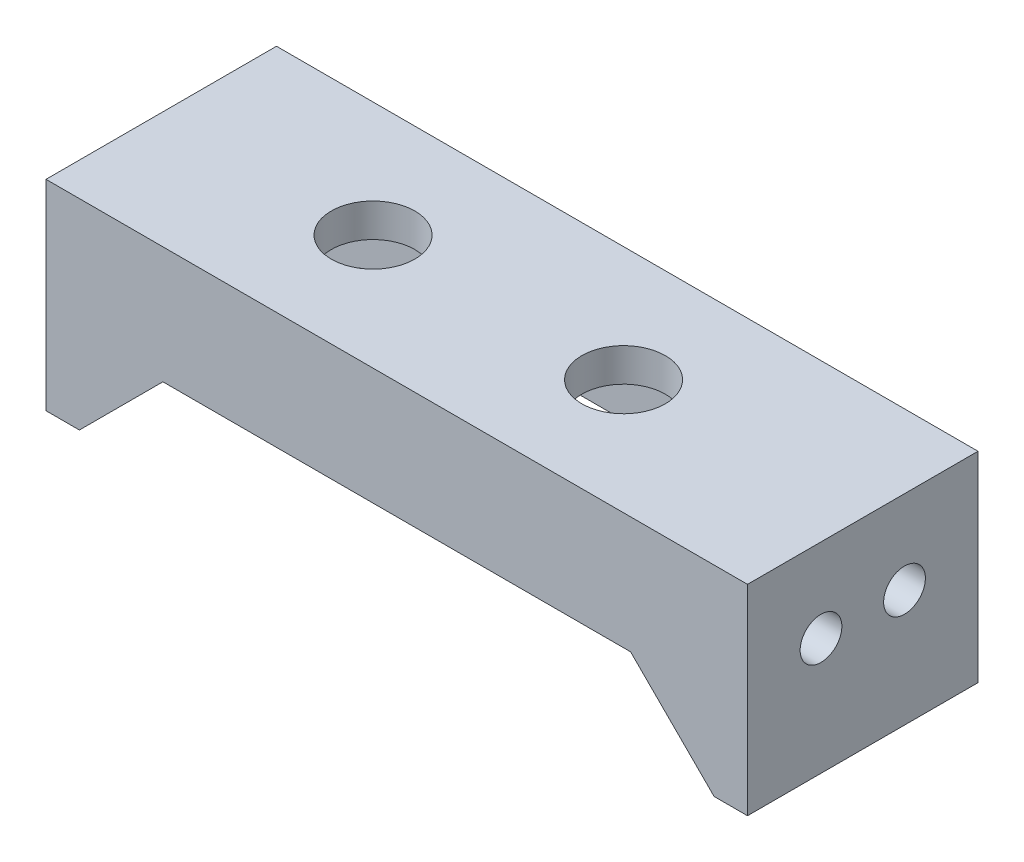
ISO-10303-21;
HEADER;
FILE_DESCRIPTION(('STEP AP214'),'2;1');
FILE_NAME('part.step','',(''),(''),'','','');
FILE_SCHEMA(('AUTOMOTIVE_DESIGN { 1 0 10303 214 1 1 1 1 }'));
ENDSEC;
DATA;
#1=APPLICATION_CONTEXT('core data for automotive mechanical design processes');
#2=APPLICATION_PROTOCOL_DEFINITION('international standard','automotive_design',2000,#1);
#3=PRODUCT_CONTEXT('',#1,'mechanical');
#4=PRODUCT('Part','Part','',(#3));
#5=PRODUCT_RELATED_PRODUCT_CATEGORY('part','',(#4));
#6=PRODUCT_DEFINITION_FORMATION('','',#4);
#7=PRODUCT_DEFINITION_CONTEXT('part definition',#1,'design');
#8=PRODUCT_DEFINITION('design','',#6,#7);
#9=PRODUCT_DEFINITION_SHAPE('','',#8);
#10=(LENGTH_UNIT() NAMED_UNIT(*) SI_UNIT(.MILLI.,.METRE.));
#11=(NAMED_UNIT(*) PLANE_ANGLE_UNIT() SI_UNIT($,.RADIAN.));
#12=(NAMED_UNIT(*) SI_UNIT($,.STERADIAN.) SOLID_ANGLE_UNIT());
#13=UNCERTAINTY_MEASURE_WITH_UNIT(LENGTH_MEASURE(1.E-05),#10,'distance_accuracy_value','');
#14=(GEOMETRIC_REPRESENTATION_CONTEXT(3) GLOBAL_UNCERTAINTY_ASSIGNED_CONTEXT((#13)) GLOBAL_UNIT_ASSIGNED_CONTEXT((#10,
#11,#12)) REPRESENTATION_CONTEXT('',''));
#15=CARTESIAN_POINT('',(0.,0.,0.));
#16=DIRECTION('',(0.,0.,1.));
#17=DIRECTION('',(1.,0.,0.));
#18=AXIS2_PLACEMENT_3D('',#15,#16,#17);
#19=CARTESIAN_POINT('',(0.,0.,0.));
#20=DIRECTION('',(0.,1.,0.));
#21=DIRECTION('',(0.,0.,1.));
#22=AXIS2_PLACEMENT_3D('',#19,#20,#21);
#23=PLANE('',#22);
#24=CARTESIAN_POINT('',(-8.31990662492034,0.,0.));
#25=DIRECTION('',(0.,-1.,0.));
#26=DIRECTION('',(0.,0.,-1.));
#27=AXIS2_PLACEMENT_3D('',#24,#25,#26);
#28=CIRCLE('',#27,2.5);
#29=CARTESIAN_POINT('',(-8.31990662492034,0.,-2.5));
#30=VERTEX_POINT('',#29);
#31=EDGE_CURVE('E274',#30,#30,#28,.T.);
#32=ORIENTED_EDGE('',*,*,#31,.F.);
#33=EDGE_LOOP('',(#32));
#34=FACE_BOUND('',#33,.T.);
#35=CARTESIAN_POINT('',(6.68009337507966,0.,0.));
#36=DIRECTION('',(0.,-1.,0.));
#37=DIRECTION('',(0.,0.,-1.));
#38=AXIS2_PLACEMENT_3D('',#35,#36,#37);
#39=CIRCLE('',#38,2.5);
#40=CARTESIAN_POINT('',(6.68009337507966,0.,-2.5));
#41=VERTEX_POINT('',#40);
#42=EDGE_CURVE('E267',#41,#41,#39,.T.);
#43=ORIENTED_EDGE('',*,*,#42,.F.);
#44=EDGE_LOOP('',(#43));
#45=FACE_BOUND('',#44,.T.);
#46=DIRECTION('',(0.,0.,1.));
#47=VECTOR('',#46,1.);
#48=CARTESIAN_POINT('',(-19.,0.,6.9));
#49=LINE('',#48,#47);
#50=CARTESIAN_POINT('',(-19.,0.,-4.9));
#51=VERTEX_POINT('',#50);
#52=CARTESIAN_POINT('',(-19.,0.,4.9));
#53=VERTEX_POINT('',#52);
#54=EDGE_CURVE('E153',#51,#53,#49,.T.);
#55=ORIENTED_EDGE('',*,*,#54,.F.);
#56=DIRECTION('',(-1.,0.,0.));
#57=VECTOR('',#56,1.);
#58=CARTESIAN_POINT('',(-19.,0.,-4.9));
#59=LINE('',#58,#57);
#60=CARTESIAN_POINT('',(19.,0.,-4.9));
#61=VERTEX_POINT('',#60);
#62=EDGE_CURVE('E138',#61,#51,#59,.T.);
#63=ORIENTED_EDGE('',*,*,#62,.F.);
#64=DIRECTION('',(0.,0.,-1.));
#65=VECTOR('',#64,1.);
#66=CARTESIAN_POINT('',(19.,0.,6.9));
#67=LINE('',#66,#65);
#68=CARTESIAN_POINT('',(19.,0.,4.9));
#69=VERTEX_POINT('',#68);
#70=EDGE_CURVE('E208',#69,#61,#67,.T.);
#71=ORIENTED_EDGE('',*,*,#70,.F.);
#72=DIRECTION('',(-1.,0.,0.));
#73=VECTOR('',#72,1.);
#74=CARTESIAN_POINT('',(-19.,0.,4.9));
#75=LINE('',#74,#73);
#76=EDGE_CURVE('E160',#69,#53,#75,.T.);
#77=ORIENTED_EDGE('',*,*,#76,.T.);
#78=EDGE_LOOP('',(#55,#63,#71,#77));
#79=FACE_BOUND('',#78,.T.);
#80=ADVANCED_FACE('F37',(#34,#45,#79),#23,.F.);
#81=CARTESIAN_POINT('',(21.,2.,-6.9));
#82=DIRECTION('',(-1.,0.,0.));
#83=DIRECTION('',(0.,0.,1.));
#84=AXIS2_PLACEMENT_3D('',#81,#82,#83);
#85=PLANE('',#84);
#86=CARTESIAN_POINT('',(21.,-3.,2.5));
#87=DIRECTION('',(1.,0.,0.));
#88=DIRECTION('',(0.,0.,-1.));
#89=AXIS2_PLACEMENT_3D('',#86,#87,#88);
#90=CIRCLE('',#89,1.25);
#91=CARTESIAN_POINT('',(21.,-3.,1.25));
#92=VERTEX_POINT('',#91);
#93=EDGE_CURVE('E283',#92,#92,#90,.T.);
#94=ORIENTED_EDGE('',*,*,#93,.F.);
#95=EDGE_LOOP('',(#94));
#96=FACE_BOUND('',#95,.T.);
#97=CARTESIAN_POINT('',(21.,-3.,-2.5));
#98=DIRECTION('',(1.,0.,0.));
#99=DIRECTION('',(0.,0.,-1.));
#100=AXIS2_PLACEMENT_3D('',#97,#98,#99);
#101=CIRCLE('',#100,1.25);
#102=CARTESIAN_POINT('',(21.,-3.,-3.75));
#103=VERTEX_POINT('',#102);
#104=EDGE_CURVE('E294',#103,#103,#101,.T.);
#105=ORIENTED_EDGE('',*,*,#104,.F.);
#106=EDGE_LOOP('',(#105));
#107=FACE_BOUND('',#106,.T.);
#108=DIRECTION('',(0.,-1.,0.));
#109=VECTOR('',#108,1.);
#110=CARTESIAN_POINT('',(21.,2.,6.9));
#111=LINE('',#110,#109);
#112=CARTESIAN_POINT('',(21.,2.,6.9));
#113=VERTEX_POINT('',#112);
#114=CARTESIAN_POINT('',(21.,-10.,6.9));
#115=VERTEX_POINT('',#114);
#116=EDGE_CURVE('E181',#113,#115,#111,.T.);
#117=ORIENTED_EDGE('',*,*,#116,.T.);
#118=DIRECTION('',(0.,0.,1.));
#119=VECTOR('',#118,1.);
#120=CARTESIAN_POINT('',(21.,-10.,6.9));
#121=LINE('',#120,#119);
#122=CARTESIAN_POINT('',(21.,-10.,-6.9));
#123=VERTEX_POINT('',#122);
#124=EDGE_CURVE('E209',#123,#115,#121,.T.);
#125=ORIENTED_EDGE('',*,*,#124,.F.);
#126=DIRECTION('',(0.,-1.,0.));
#127=VECTOR('',#126,1.);
#128=CARTESIAN_POINT('',(21.,2.,-6.9));
#129=LINE('',#128,#127);
#130=CARTESIAN_POINT('',(21.,2.,-6.9));
#131=VERTEX_POINT('',#130);
#132=EDGE_CURVE('E11',#131,#123,#129,.T.);
#133=ORIENTED_EDGE('',*,*,#132,.F.);
#134=DIRECTION('',(0.,0.,-1.));
#135=VECTOR('',#134,1.);
#136=CARTESIAN_POINT('',(21.,2.,-6.9));
#137=LINE('',#136,#135);
#138=EDGE_CURVE('E174',#113,#131,#137,.T.);
#139=ORIENTED_EDGE('',*,*,#138,.F.);
#140=EDGE_LOOP('',(#117,#125,#133,#139));
#141=FACE_BOUND('',#140,.T.);
#142=ADVANCED_FACE('F39',(#96,#107,#141),#85,.F.);
#143=CARTESIAN_POINT('',(-21.,2.,-6.9));
#144=DIRECTION('',(0.,0.,1.));
#145=DIRECTION('',(1.,0.,0.));
#146=AXIS2_PLACEMENT_3D('',#143,#144,#145);
#147=PLANE('',#146);
#148=ORIENTED_EDGE('',*,*,#132,.T.);
#149=DIRECTION('',(1.,0.,0.));
#150=VECTOR('',#149,1.);
#151=CARTESIAN_POINT('',(21.,-10.,-6.9));
#152=LINE('',#151,#150);
#153=CARTESIAN_POINT('',(19.,-10.,-6.9));
#154=VERTEX_POINT('',#153);
#155=EDGE_CURVE('E162',#154,#123,#152,.T.);
#156=ORIENTED_EDGE('',*,*,#155,.F.);
#157=DIRECTION('',(0.707106781186548,-0.707106781186547,0.));
#158=VECTOR('',#157,1.);
#159=CARTESIAN_POINT('',(19.,-10.,-6.9));
#160=LINE('',#159,#158);
#161=CARTESIAN_POINT('',(14.,-5.,-6.9));
#162=VERTEX_POINT('',#161);
#163=EDGE_CURVE('E258',#162,#154,#160,.T.);
#164=ORIENTED_EDGE('',*,*,#163,.F.);
#165=DIRECTION('',(1.,0.,0.));
#166=VECTOR('',#165,1.);
#167=CARTESIAN_POINT('',(-14.,-5.,-6.9));
#168=LINE('',#167,#166);
#169=CARTESIAN_POINT('',(-14.,-5.,-6.9));
#170=VERTEX_POINT('',#169);
#171=EDGE_CURVE('E256',#170,#162,#168,.T.);
#172=ORIENTED_EDGE('',*,*,#171,.F.);
#173=DIRECTION('',(0.707106781186548,0.707106781186547,0.));
#174=VECTOR('',#173,1.);
#175=CARTESIAN_POINT('',(-19.,-10.,-6.9));
#176=LINE('',#175,#174);
#177=CARTESIAN_POINT('',(-19.,-10.,-6.9));
#178=VERTEX_POINT('',#177);
#179=EDGE_CURVE('E157',#178,#170,#176,.T.);
#180=ORIENTED_EDGE('',*,*,#179,.F.);
#181=DIRECTION('',(1.,0.,0.));
#182=VECTOR('',#181,1.);
#183=CARTESIAN_POINT('',(-21.,-10.,-6.9));
#184=LINE('',#183,#182);
#185=CARTESIAN_POINT('',(-21.,-10.,-6.9));
#186=VERTEX_POINT('',#185);
#187=EDGE_CURVE('E165',#186,#178,#184,.T.);
#188=ORIENTED_EDGE('',*,*,#187,.F.);
#189=DIRECTION('',(0.,-1.,0.));
#190=VECTOR('',#189,1.);
#191=CARTESIAN_POINT('',(-21.,2.,-6.9));
#192=LINE('',#191,#190);
#193=CARTESIAN_POINT('',(-21.,2.,-6.9));
#194=VERTEX_POINT('',#193);
#195=EDGE_CURVE('E45',#194,#186,#192,.T.);
#196=ORIENTED_EDGE('',*,*,#195,.F.);
#197=DIRECTION('',(-1.,0.,0.));
#198=VECTOR('',#197,1.);
#199=CARTESIAN_POINT('',(-21.,2.,-6.9));
#200=LINE('',#199,#198);
#201=EDGE_CURVE('E176',#131,#194,#200,.T.);
#202=ORIENTED_EDGE('',*,*,#201,.F.);
#203=EDGE_LOOP('',(#148,#156,#164,#172,#180,#188,#196,#202));
#204=FACE_BOUND('',#203,.T.);
#205=ADVANCED_FACE('F193',(#204),#147,.F.);
#206=CARTESIAN_POINT('',(-21.,2.,-6.9));
#207=DIRECTION('',(1.,0.,0.));
#208=DIRECTION('',(0.,0.,-1.));
#209=AXIS2_PLACEMENT_3D('',#206,#207,#208);
#210=PLANE('',#209);
#211=CARTESIAN_POINT('',(-21.,-3.,2.5));
#212=DIRECTION('',(1.,0.,0.));
#213=DIRECTION('',(0.,0.,-1.));
#214=AXIS2_PLACEMENT_3D('',#211,#212,#213);
#215=CIRCLE('',#214,1.25);
#216=CARTESIAN_POINT('',(-21.,-3.,1.25));
#217=VERTEX_POINT('',#216);
#218=EDGE_CURVE('E271',#217,#217,#215,.T.);
#219=ORIENTED_EDGE('',*,*,#218,.T.);
#220=EDGE_LOOP('',(#219));
#221=FACE_BOUND('',#220,.T.);
#222=CARTESIAN_POINT('',(-21.,-3.,-2.5));
#223=DIRECTION('',(1.,0.,0.));
#224=DIRECTION('',(0.,0.,-1.));
#225=AXIS2_PLACEMENT_3D('',#222,#223,#224);
#226=CIRCLE('',#225,1.25);
#227=CARTESIAN_POINT('',(-21.,-3.,-3.75));
#228=VERTEX_POINT('',#227);
#229=EDGE_CURVE('E282',#228,#228,#226,.T.);
#230=ORIENTED_EDGE('',*,*,#229,.T.);
#231=EDGE_LOOP('',(#230));
#232=FACE_BOUND('',#231,.T.);
#233=ORIENTED_EDGE('',*,*,#195,.T.);
#234=DIRECTION('',(0.,0.,-1.));
#235=VECTOR('',#234,1.);
#236=CARTESIAN_POINT('',(-21.,-10.,6.9));
#237=LINE('',#236,#235);
#238=CARTESIAN_POINT('',(-21.,-10.,6.9));
#239=VERTEX_POINT('',#238);
#240=EDGE_CURVE('E161',#239,#186,#237,.T.);
#241=ORIENTED_EDGE('',*,*,#240,.F.);
#242=DIRECTION('',(0.,-1.,0.));
#243=VECTOR('',#242,1.);
#244=CARTESIAN_POINT('',(-21.,2.,6.9));
#245=LINE('',#244,#243);
#246=CARTESIAN_POINT('',(-21.,2.,6.9));
#247=VERTEX_POINT('',#246);
#248=EDGE_CURVE('E183',#247,#239,#245,.T.);
#249=ORIENTED_EDGE('',*,*,#248,.F.);
#250=DIRECTION('',(0.,0.,1.));
#251=VECTOR('',#250,1.);
#252=CARTESIAN_POINT('',(-21.,2.,-6.9));
#253=LINE('',#252,#251);
#254=EDGE_CURVE('E178',#194,#247,#253,.T.);
#255=ORIENTED_EDGE('',*,*,#254,.F.);
#256=EDGE_LOOP('',(#233,#241,#249,#255));
#257=FACE_BOUND('',#256,.T.);
#258=ADVANCED_FACE('F189',(#221,#232,#257),#210,.F.);
#259=CARTESIAN_POINT('',(-21.,2.,6.9));
#260=DIRECTION('',(0.,0.,-1.));
#261=DIRECTION('',(-1.,0.,0.));
#262=AXIS2_PLACEMENT_3D('',#259,#260,#261);
#263=PLANE('',#262);
#264=ORIENTED_EDGE('',*,*,#248,.T.);
#265=DIRECTION('',(-1.,0.,0.));
#266=VECTOR('',#265,1.);
#267=CARTESIAN_POINT('',(-21.,-10.,6.9));
#268=LINE('',#267,#266);
#269=CARTESIAN_POINT('',(-19.,-10.,6.9));
#270=VERTEX_POINT('',#269);
#271=EDGE_CURVE('E172',#270,#239,#268,.T.);
#272=ORIENTED_EDGE('',*,*,#271,.F.);
#273=DIRECTION('',(0.707106781186548,0.707106781186547,0.));
#274=VECTOR('',#273,1.);
#275=CARTESIAN_POINT('',(-19.,-10.,6.9));
#276=LINE('',#275,#274);
#277=CARTESIAN_POINT('',(-14.,-5.,6.9));
#278=VERTEX_POINT('',#277);
#279=EDGE_CURVE('E231',#270,#278,#276,.T.);
#280=ORIENTED_EDGE('',*,*,#279,.T.);
#281=DIRECTION('',(1.,0.,0.));
#282=VECTOR('',#281,1.);
#283=CARTESIAN_POINT('',(-14.,-5.,6.9));
#284=LINE('',#283,#282);
#285=CARTESIAN_POINT('',(14.,-5.,6.9));
#286=VERTEX_POINT('',#285);
#287=EDGE_CURVE('E228',#278,#286,#284,.T.);
#288=ORIENTED_EDGE('',*,*,#287,.T.);
#289=DIRECTION('',(0.707106781186548,-0.707106781186547,0.));
#290=VECTOR('',#289,1.);
#291=CARTESIAN_POINT('',(19.,-10.,6.9));
#292=LINE('',#291,#290);
#293=CARTESIAN_POINT('',(19.,-10.,6.9));
#294=VERTEX_POINT('',#293);
#295=EDGE_CURVE('E224',#286,#294,#292,.T.);
#296=ORIENTED_EDGE('',*,*,#295,.T.);
#297=DIRECTION('',(-1.,0.,0.));
#298=VECTOR('',#297,1.);
#299=CARTESIAN_POINT('',(21.,-10.,6.9));
#300=LINE('',#299,#298);
#301=EDGE_CURVE('E215',#115,#294,#300,.T.);
#302=ORIENTED_EDGE('',*,*,#301,.F.);
#303=ORIENTED_EDGE('',*,*,#116,.F.);
#304=DIRECTION('',(1.,0.,0.));
#305=VECTOR('',#304,1.);
#306=CARTESIAN_POINT('',(-21.,2.,6.9));
#307=LINE('',#306,#305);
#308=EDGE_CURVE('E60',#247,#113,#307,.T.);
#309=ORIENTED_EDGE('',*,*,#308,.F.);
#310=EDGE_LOOP('',(#264,#272,#280,#288,#296,#302,#303,#309));
#311=FACE_BOUND('',#310,.T.);
#312=ADVANCED_FACE('F314',(#311),#263,.F.);
#313=CARTESIAN_POINT('',(0.,2.,0.));
#314=DIRECTION('',(0.,1.,0.));
#315=DIRECTION('',(0.,0.,1.));
#316=AXIS2_PLACEMENT_3D('',#313,#314,#315);
#317=PLANE('',#316);
#318=CARTESIAN_POINT('',(-8.31990662492034,2.,0.));
#319=DIRECTION('',(0.,-1.,0.));
#320=DIRECTION('',(0.,0.,-1.));
#321=AXIS2_PLACEMENT_3D('',#318,#319,#320);
#322=CIRCLE('',#321,2.5);
#323=CARTESIAN_POINT('',(-8.31990662492034,2.,-2.5));
#324=VERTEX_POINT('',#323);
#325=EDGE_CURVE('E260',#324,#324,#322,.T.);
#326=ORIENTED_EDGE('',*,*,#325,.T.);
#327=EDGE_LOOP('',(#326));
#328=FACE_BOUND('',#327,.T.);
#329=CARTESIAN_POINT('',(6.68009337507966,2.,0.));
#330=DIRECTION('',(0.,-1.,0.));
#331=DIRECTION('',(0.,0.,-1.));
#332=AXIS2_PLACEMENT_3D('',#329,#330,#331);
#333=CIRCLE('',#332,2.5);
#334=CARTESIAN_POINT('',(6.68009337507966,2.,-2.5));
#335=VERTEX_POINT('',#334);
#336=EDGE_CURVE('E270',#335,#335,#333,.T.);
#337=ORIENTED_EDGE('',*,*,#336,.T.);
#338=EDGE_LOOP('',(#337));
#339=FACE_BOUND('',#338,.T.);
#340=ORIENTED_EDGE('',*,*,#138,.T.);
#341=ORIENTED_EDGE('',*,*,#201,.T.);
#342=ORIENTED_EDGE('',*,*,#254,.T.);
#343=ORIENTED_EDGE('',*,*,#308,.T.);
#344=EDGE_LOOP('',(#340,#341,#342,#343));
#345=FACE_BOUND('',#344,.T.);
#346=ADVANCED_FACE('F322',(#328,#339,#345),#317,.T.);
#347=CARTESIAN_POINT('',(-19.,-10.,6.9));
#348=DIRECTION('',(-1.,0.,0.));
#349=DIRECTION('',(0.,0.,1.));
#350=AXIS2_PLACEMENT_3D('',#347,#348,#349);
#351=PLANE('',#350);
#352=CARTESIAN_POINT('',(-19.,-3.,2.5));
#353=DIRECTION('',(1.,0.,0.));
#354=DIRECTION('',(0.,0.,-1.));
#355=AXIS2_PLACEMENT_3D('',#352,#353,#354);
#356=CIRCLE('',#355,1.25);
#357=CARTESIAN_POINT('',(-19.,-3.,1.25));
#358=VERTEX_POINT('',#357);
#359=EDGE_CURVE('E286',#358,#358,#356,.T.);
#360=ORIENTED_EDGE('',*,*,#359,.F.);
#361=EDGE_LOOP('',(#360));
#362=FACE_BOUND('',#361,.T.);
#363=CARTESIAN_POINT('',(-19.,-3.,-2.5));
#364=DIRECTION('',(1.,0.,0.));
#365=DIRECTION('',(0.,0.,-1.));
#366=AXIS2_PLACEMENT_3D('',#363,#364,#365);
#367=CIRCLE('',#366,1.25);
#368=CARTESIAN_POINT('',(-19.,-3.,-3.75));
#369=VERTEX_POINT('',#368);
#370=EDGE_CURVE('E279',#369,#369,#367,.T.);
#371=ORIENTED_EDGE('',*,*,#370,.F.);
#372=EDGE_LOOP('',(#371));
#373=FACE_BOUND('',#372,.T.);
#374=DIRECTION('',(0.,0.,1.));
#375=VECTOR('',#374,1.);
#376=CARTESIAN_POINT('',(-19.,-10.,6.9));
#377=LINE('',#376,#375);
#378=CARTESIAN_POINT('',(-19.,-10.,-4.9));
#379=VERTEX_POINT('',#378);
#380=CARTESIAN_POINT('',(-19.,-10.,4.9));
#381=VERTEX_POINT('',#380);
#382=EDGE_CURVE('E155',#379,#381,#377,.T.);
#383=ORIENTED_EDGE('',*,*,#382,.F.);
#384=DIRECTION('',(0.,-1.,0.));
#385=VECTOR('',#384,1.);
#386=CARTESIAN_POINT('',(-19.,-10.,-4.9));
#387=LINE('',#386,#385);
#388=EDGE_CURVE('E141',#51,#379,#387,.T.);
#389=ORIENTED_EDGE('',*,*,#388,.F.);
#390=ORIENTED_EDGE('',*,*,#54,.T.);
#391=DIRECTION('',(0.,-1.,0.));
#392=VECTOR('',#391,1.);
#393=CARTESIAN_POINT('',(-19.,-10.,4.9));
#394=LINE('',#393,#392);
#395=EDGE_CURVE('E227',#53,#381,#394,.T.);
#396=ORIENTED_EDGE('',*,*,#395,.T.);
#397=EDGE_LOOP('',(#383,#389,#390,#396));
#398=FACE_BOUND('',#397,.T.);
#399=ADVANCED_FACE('F151',(#362,#373,#398),#351,.F.);
#400=CARTESIAN_POINT('',(0.,-10.,0.));
#401=DIRECTION('',(0.,-1.,0.));
#402=DIRECTION('',(0.,0.,-1.));
#403=AXIS2_PLACEMENT_3D('',#400,#401,#402);
#404=PLANE('',#403);
#405=ORIENTED_EDGE('',*,*,#240,.T.);
#406=ORIENTED_EDGE('',*,*,#187,.T.);
#407=EDGE_CURVE('E206',#178,#379,#377,.T.);
#408=ORIENTED_EDGE('',*,*,#407,.T.);
#409=ORIENTED_EDGE('',*,*,#382,.T.);
#410=DIRECTION('',(0.,0.,1.));
#411=VECTOR('',#410,1.);
#412=CARTESIAN_POINT('',(-19.,-10.,4.9));
#413=LINE('',#412,#411);
#414=EDGE_CURVE('E203',#381,#270,#413,.T.);
#415=ORIENTED_EDGE('',*,*,#414,.T.);
#416=ORIENTED_EDGE('',*,*,#271,.T.);
#417=EDGE_LOOP('',(#405,#406,#408,#409,#415,#416));
#418=FACE_BOUND('',#417,.T.);
#419=ADVANCED_FACE('F199',(#418),#404,.T.);
#420=CARTESIAN_POINT('',(19.,-10.,6.9));
#421=DIRECTION('',(1.,0.,0.));
#422=DIRECTION('',(0.,0.,-1.));
#423=AXIS2_PLACEMENT_3D('',#420,#421,#422);
#424=PLANE('',#423);
#425=CARTESIAN_POINT('',(19.,-3.,2.5));
#426=DIRECTION('',(1.,0.,0.));
#427=DIRECTION('',(0.,0.,-1.));
#428=AXIS2_PLACEMENT_3D('',#425,#426,#427);
#429=CIRCLE('',#428,1.25);
#430=CARTESIAN_POINT('',(19.,-3.,1.25));
#431=VERTEX_POINT('',#430);
#432=EDGE_CURVE('E297',#431,#431,#429,.T.);
#433=ORIENTED_EDGE('',*,*,#432,.T.);
#434=EDGE_LOOP('',(#433));
#435=FACE_BOUND('',#434,.T.);
#436=CARTESIAN_POINT('',(19.,-3.,-2.5));
#437=DIRECTION('',(1.,0.,0.));
#438=DIRECTION('',(0.,0.,-1.));
#439=AXIS2_PLACEMENT_3D('',#436,#437,#438);
#440=CIRCLE('',#439,1.25);
#441=CARTESIAN_POINT('',(19.,-3.,-3.75));
#442=VERTEX_POINT('',#441);
#443=EDGE_CURVE('E291',#442,#442,#440,.T.);
#444=ORIENTED_EDGE('',*,*,#443,.T.);
#445=EDGE_LOOP('',(#444));
#446=FACE_BOUND('',#445,.T.);
#447=ORIENTED_EDGE('',*,*,#70,.T.);
#448=DIRECTION('',(0.,1.,0.));
#449=VECTOR('',#448,1.);
#450=CARTESIAN_POINT('',(19.,-10.,-4.9));
#451=LINE('',#450,#449);
#452=CARTESIAN_POINT('',(19.,-10.,-4.9));
#453=VERTEX_POINT('',#452);
#454=EDGE_CURVE('E144',#453,#61,#451,.T.);
#455=ORIENTED_EDGE('',*,*,#454,.F.);
#456=DIRECTION('',(0.,0.,-1.));
#457=VECTOR('',#456,1.);
#458=CARTESIAN_POINT('',(19.,-10.,6.9));
#459=LINE('',#458,#457);
#460=CARTESIAN_POINT('',(19.,-10.,4.9));
#461=VERTEX_POINT('',#460);
#462=EDGE_CURVE('E214',#461,#453,#459,.T.);
#463=ORIENTED_EDGE('',*,*,#462,.F.);
#464=DIRECTION('',(0.,1.,0.));
#465=VECTOR('',#464,1.);
#466=CARTESIAN_POINT('',(19.,-10.,4.9));
#467=LINE('',#466,#465);
#468=EDGE_CURVE('E235',#461,#69,#467,.T.);
#469=ORIENTED_EDGE('',*,*,#468,.T.);
#470=EDGE_LOOP('',(#447,#455,#463,#469));
#471=FACE_BOUND('',#470,.T.);
#472=ADVANCED_FACE('F536',(#435,#446,#471),#424,.F.);
#473=CARTESIAN_POINT('',(0.,-10.,0.));
#474=DIRECTION('',(0.,1.,0.));
#475=DIRECTION('',(0.,0.,1.));
#476=AXIS2_PLACEMENT_3D('',#473,#474,#475);
#477=PLANE('',#476);
#478=ORIENTED_EDGE('',*,*,#124,.T.);
#479=ORIENTED_EDGE('',*,*,#301,.T.);
#480=EDGE_CURVE('E168',#294,#461,#459,.T.);
#481=ORIENTED_EDGE('',*,*,#480,.T.);
#482=ORIENTED_EDGE('',*,*,#462,.T.);
#483=DIRECTION('',(0.,0.,-1.));
#484=VECTOR('',#483,1.);
#485=CARTESIAN_POINT('',(19.,-10.,-4.9));
#486=LINE('',#485,#484);
#487=EDGE_CURVE('E246',#453,#154,#486,.T.);
#488=ORIENTED_EDGE('',*,*,#487,.T.);
#489=ORIENTED_EDGE('',*,*,#155,.T.);
#490=EDGE_LOOP('',(#478,#479,#481,#482,#488,#489));
#491=FACE_BOUND('',#490,.T.);
#492=ADVANCED_FACE('F317',(#491),#477,.F.);
#493=CARTESIAN_POINT('',(19.,-10.,4.9));
#494=DIRECTION('',(-0.707106781186547,-0.707106781186548,0.));
#495=DIRECTION('',(0.707106781186548,-0.707106781186547,0.));
#496=AXIS2_PLACEMENT_3D('',#493,#494,#495);
#497=PLANE('',#496);
#498=ORIENTED_EDGE('',*,*,#295,.F.);
#499=DIRECTION('',(0.,0.,1.));
#500=VECTOR('',#499,1.);
#501=CARTESIAN_POINT('',(14.,-5.,4.9));
#502=LINE('',#501,#500);
#503=CARTESIAN_POINT('',(14.,-5.,4.9));
#504=VERTEX_POINT('',#503);
#505=EDGE_CURVE('E210',#504,#286,#502,.T.);
#506=ORIENTED_EDGE('',*,*,#505,.F.);
#507=DIRECTION('',(0.707106781186548,-0.707106781186547,0.));
#508=VECTOR('',#507,1.);
#509=CARTESIAN_POINT('',(19.,-10.,4.9));
#510=LINE('',#509,#508);
#511=EDGE_CURVE('E52',#504,#461,#510,.T.);
#512=ORIENTED_EDGE('',*,*,#511,.T.);
#513=ORIENTED_EDGE('',*,*,#480,.F.);
#514=EDGE_LOOP('',(#498,#506,#512,#513));
#515=FACE_BOUND('',#514,.T.);
#516=ADVANCED_FACE('F369',(#515),#497,.T.);
#517=CARTESIAN_POINT('',(-14.,-5.,4.9));
#518=DIRECTION('',(0.,-1.,0.));
#519=DIRECTION('',(0.,0.,-1.));
#520=AXIS2_PLACEMENT_3D('',#517,#518,#519);
#521=PLANE('',#520);
#522=ORIENTED_EDGE('',*,*,#287,.F.);
#523=DIRECTION('',(0.,0.,1.));
#524=VECTOR('',#523,1.);
#525=CARTESIAN_POINT('',(-14.,-5.,4.9));
#526=LINE('',#525,#524);
#527=CARTESIAN_POINT('',(-14.,-5.,4.9));
#528=VERTEX_POINT('',#527);
#529=EDGE_CURVE('E221',#528,#278,#526,.T.);
#530=ORIENTED_EDGE('',*,*,#529,.F.);
#531=DIRECTION('',(1.,0.,0.));
#532=VECTOR('',#531,1.);
#533=CARTESIAN_POINT('',(-14.,-5.,4.9));
#534=LINE('',#533,#532);
#535=EDGE_CURVE('E239',#528,#504,#534,.T.);
#536=ORIENTED_EDGE('',*,*,#535,.T.);
#537=ORIENTED_EDGE('',*,*,#505,.T.);
#538=EDGE_LOOP('',(#522,#530,#536,#537));
#539=FACE_BOUND('',#538,.T.);
#540=ADVANCED_FACE('F373',(#539),#521,.T.);
#541=CARTESIAN_POINT('',(-19.,-10.,4.9));
#542=DIRECTION('',(0.707106781186547,-0.707106781186548,0.));
#543=DIRECTION('',(0.707106781186548,0.707106781186547,0.));
#544=AXIS2_PLACEMENT_3D('',#541,#542,#543);
#545=PLANE('',#544);
#546=ORIENTED_EDGE('',*,*,#279,.F.);
#547=ORIENTED_EDGE('',*,*,#414,.F.);
#548=DIRECTION('',(0.707106781186548,0.707106781186547,0.));
#549=VECTOR('',#548,1.);
#550=CARTESIAN_POINT('',(-19.,-10.,4.9));
#551=LINE('',#550,#549);
#552=EDGE_CURVE('E242',#381,#528,#551,.T.);
#553=ORIENTED_EDGE('',*,*,#552,.T.);
#554=ORIENTED_EDGE('',*,*,#529,.T.);
#555=EDGE_LOOP('',(#546,#547,#553,#554));
#556=FACE_BOUND('',#555,.T.);
#557=ADVANCED_FACE('F383',(#556),#545,.T.);
#558=CARTESIAN_POINT('',(0.,0.,4.9));
#559=DIRECTION('',(0.,0.,-1.));
#560=DIRECTION('',(-1.,0.,0.));
#561=AXIS2_PLACEMENT_3D('',#558,#559,#560);
#562=PLANE('',#561);
#563=ORIENTED_EDGE('',*,*,#395,.F.);
#564=ORIENTED_EDGE('',*,*,#76,.F.);
#565=ORIENTED_EDGE('',*,*,#468,.F.);
#566=ORIENTED_EDGE('',*,*,#511,.F.);
#567=ORIENTED_EDGE('',*,*,#535,.F.);
#568=ORIENTED_EDGE('',*,*,#552,.F.);
#569=EDGE_LOOP('',(#563,#564,#565,#566,#567,#568));
#570=FACE_BOUND('',#569,.T.);
#571=ADVANCED_FACE('F392',(#570),#562,.T.);
#572=CARTESIAN_POINT('',(-19.,-10.,-4.9));
#573=DIRECTION('',(-0.707106781186547,0.707106781186548,0.));
#574=DIRECTION('',(-0.707106781186548,-0.707106781186547,0.));
#575=AXIS2_PLACEMENT_3D('',#572,#573,#574);
#576=PLANE('',#575);
#577=ORIENTED_EDGE('',*,*,#179,.T.);
#578=DIRECTION('',(0.,0.,-1.));
#579=VECTOR('',#578,1.);
#580=CARTESIAN_POINT('',(-14.,-5.,-4.9));
#581=LINE('',#580,#579);
#582=CARTESIAN_POINT('',(-14.,-5.,-4.9));
#583=VERTEX_POINT('',#582);
#584=EDGE_CURVE('E233',#583,#170,#581,.T.);
#585=ORIENTED_EDGE('',*,*,#584,.F.);
#586=DIRECTION('',(0.707106781186548,0.707106781186547,0.));
#587=VECTOR('',#586,1.);
#588=CARTESIAN_POINT('',(-19.,-10.,-4.9));
#589=LINE('',#588,#587);
#590=EDGE_CURVE('E250',#379,#583,#589,.T.);
#591=ORIENTED_EDGE('',*,*,#590,.F.);
#592=ORIENTED_EDGE('',*,*,#407,.F.);
#593=EDGE_LOOP('',(#577,#585,#591,#592));
#594=FACE_BOUND('',#593,.T.);
#595=ADVANCED_FACE('F401',(#594),#576,.F.);
#596=CARTESIAN_POINT('',(-14.,-5.,-4.9));
#597=DIRECTION('',(0.,1.,0.));
#598=DIRECTION('',(0.,0.,1.));
#599=AXIS2_PLACEMENT_3D('',#596,#597,#598);
#600=PLANE('',#599);
#601=ORIENTED_EDGE('',*,*,#171,.T.);
#602=DIRECTION('',(0.,0.,-1.));
#603=VECTOR('',#602,1.);
#604=CARTESIAN_POINT('',(14.,-5.,-4.9));
#605=LINE('',#604,#603);
#606=CARTESIAN_POINT('',(14.,-5.,-4.9));
#607=VERTEX_POINT('',#606);
#608=EDGE_CURVE('E249',#607,#162,#605,.T.);
#609=ORIENTED_EDGE('',*,*,#608,.F.);
#610=DIRECTION('',(1.,0.,0.));
#611=VECTOR('',#610,1.);
#612=CARTESIAN_POINT('',(-14.,-5.,-4.9));
#613=LINE('',#612,#611);
#614=EDGE_CURVE('E262',#583,#607,#613,.T.);
#615=ORIENTED_EDGE('',*,*,#614,.F.);
#616=ORIENTED_EDGE('',*,*,#584,.T.);
#617=EDGE_LOOP('',(#601,#609,#615,#616));
#618=FACE_BOUND('',#617,.T.);
#619=ADVANCED_FACE('F411',(#618),#600,.F.);
#620=CARTESIAN_POINT('',(19.,-10.,-4.9));
#621=DIRECTION('',(0.707106781186547,0.707106781186548,0.));
#622=DIRECTION('',(-0.707106781186548,0.707106781186547,0.));
#623=AXIS2_PLACEMENT_3D('',#620,#621,#622);
#624=PLANE('',#623);
#625=ORIENTED_EDGE('',*,*,#163,.T.);
#626=ORIENTED_EDGE('',*,*,#487,.F.);
#627=DIRECTION('',(0.707106781186548,-0.707106781186547,0.));
#628=VECTOR('',#627,1.);
#629=CARTESIAN_POINT('',(19.,-10.,-4.9));
#630=LINE('',#629,#628);
#631=EDGE_CURVE('E264',#607,#453,#630,.T.);
#632=ORIENTED_EDGE('',*,*,#631,.F.);
#633=ORIENTED_EDGE('',*,*,#608,.T.);
#634=EDGE_LOOP('',(#625,#626,#632,#633));
#635=FACE_BOUND('',#634,.T.);
#636=ADVANCED_FACE('F420',(#635),#624,.F.);
#637=CARTESIAN_POINT('',(0.,0.,-4.9));
#638=DIRECTION('',(0.,0.,1.));
#639=DIRECTION('',(-1.,0.,0.));
#640=AXIS2_PLACEMENT_3D('',#637,#638,#639);
#641=PLANE('',#640);
#642=ORIENTED_EDGE('',*,*,#388,.T.);
#643=ORIENTED_EDGE('',*,*,#590,.T.);
#644=ORIENTED_EDGE('',*,*,#614,.T.);
#645=ORIENTED_EDGE('',*,*,#631,.T.);
#646=ORIENTED_EDGE('',*,*,#454,.T.);
#647=ORIENTED_EDGE('',*,*,#62,.T.);
#648=EDGE_LOOP('',(#642,#643,#644,#645,#646,#647));
#649=FACE_BOUND('',#648,.T.);
#650=ADVANCED_FACE('F140',(#649),#641,.T.);
#651=CARTESIAN_POINT('',(6.68009337507966,2.,0.));
#652=DIRECTION('',(0.,-1.,0.));
#653=DIRECTION('',(0.,0.,-1.));
#654=AXIS2_PLACEMENT_3D('',#651,#652,#653);
#655=CYLINDRICAL_SURFACE('',#654,2.5);
#656=ORIENTED_EDGE('',*,*,#336,.F.);
#657=EDGE_LOOP('',(#656));
#658=FACE_BOUND('',#657,.T.);
#659=ORIENTED_EDGE('',*,*,#42,.T.);
#660=EDGE_LOOP('',(#659));
#661=FACE_BOUND('',#660,.T.);
#662=ADVANCED_FACE('F435',(#658,#661),#655,.F.);
#663=CARTESIAN_POINT('',(-8.31990662492034,2.,0.));
#664=DIRECTION('',(0.,-1.,0.));
#665=DIRECTION('',(0.,0.,-1.));
#666=AXIS2_PLACEMENT_3D('',#663,#664,#665);
#667=CYLINDRICAL_SURFACE('',#666,2.5);
#668=ORIENTED_EDGE('',*,*,#325,.F.);
#669=EDGE_LOOP('',(#668));
#670=FACE_BOUND('',#669,.T.);
#671=ORIENTED_EDGE('',*,*,#31,.T.);
#672=EDGE_LOOP('',(#671));
#673=FACE_BOUND('',#672,.T.);
#674=ADVANCED_FACE('F442',(#670,#673),#667,.F.);
#675=CARTESIAN_POINT('',(-21.,-3.,-2.5));
#676=DIRECTION('',(1.,0.,0.));
#677=DIRECTION('',(0.,0.,-1.));
#678=AXIS2_PLACEMENT_3D('',#675,#676,#677);
#679=CYLINDRICAL_SURFACE('',#678,1.25);
#680=ORIENTED_EDGE('',*,*,#229,.F.);
#681=EDGE_LOOP('',(#680));
#682=FACE_BOUND('',#681,.T.);
#683=ORIENTED_EDGE('',*,*,#370,.T.);
#684=EDGE_LOOP('',(#683));
#685=FACE_BOUND('',#684,.T.);
#686=ADVANCED_FACE('F449',(#682,#685),#679,.F.);
#687=CARTESIAN_POINT('',(-21.,-3.,2.5));
#688=DIRECTION('',(1.,0.,0.));
#689=DIRECTION('',(0.,0.,-1.));
#690=AXIS2_PLACEMENT_3D('',#687,#688,#689);
#691=CYLINDRICAL_SURFACE('',#690,1.25);
#692=ORIENTED_EDGE('',*,*,#218,.F.);
#693=EDGE_LOOP('',(#692));
#694=FACE_BOUND('',#693,.T.);
#695=ORIENTED_EDGE('',*,*,#359,.T.);
#696=EDGE_LOOP('',(#695));
#697=FACE_BOUND('',#696,.T.);
#698=ADVANCED_FACE('F457',(#694,#697),#691,.F.);
#699=CARTESIAN_POINT('',(21.,-3.,-2.5));
#700=DIRECTION('',(-1.,0.,0.));
#701=DIRECTION('',(0.,0.,1.));
#702=AXIS2_PLACEMENT_3D('',#699,#700,#701);
#703=CYLINDRICAL_SURFACE('',#702,1.25);
#704=ORIENTED_EDGE('',*,*,#104,.T.);
#705=EDGE_LOOP('',(#704));
#706=FACE_BOUND('',#705,.T.);
#707=ORIENTED_EDGE('',*,*,#443,.F.);
#708=EDGE_LOOP('',(#707));
#709=FACE_BOUND('',#708,.T.);
#710=ADVANCED_FACE('F465',(#706,#709),#703,.F.);
#711=CARTESIAN_POINT('',(21.,-3.,2.5));
#712=DIRECTION('',(-1.,0.,0.));
#713=DIRECTION('',(0.,0.,1.));
#714=AXIS2_PLACEMENT_3D('',#711,#712,#713);
#715=CYLINDRICAL_SURFACE('',#714,1.25);
#716=ORIENTED_EDGE('',*,*,#93,.T.);
#717=EDGE_LOOP('',(#716));
#718=FACE_BOUND('',#717,.T.);
#719=ORIENTED_EDGE('',*,*,#432,.F.);
#720=EDGE_LOOP('',(#719));
#721=FACE_BOUND('',#720,.T.);
#722=ADVANCED_FACE('F303',(#718,#721),#715,.F.);
#723=CLOSED_SHELL('',(#80,#142,#205,#258,#312,#346,#399,#419,#472,#492,#516,#540,#557,#571,#595,
#619,#636,#650,#662,#674,#686,#698,#710,#722));
#724=MANIFOLD_SOLID_BREP('B2',#723);
#725=ADVANCED_BREP_SHAPE_REPRESENTATION('',(#18,#724),#14);
#726=SHAPE_DEFINITION_REPRESENTATION(#9,#725);
ENDSEC;
END-ISO-10303-21;
